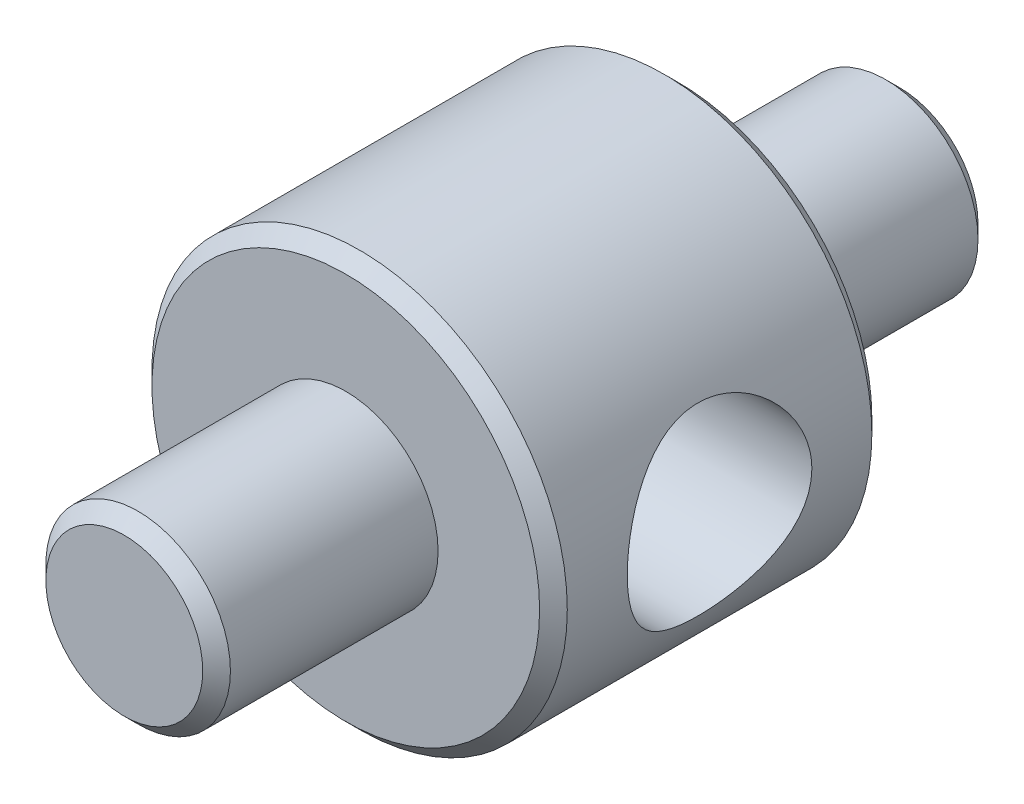
ISO-10303-21;
HEADER;
FILE_DESCRIPTION(('STEP AP214'),'2;1');
FILE_NAME('part.step','',(''),(''),'','','');
FILE_SCHEMA(('AUTOMOTIVE_DESIGN { 1 0 10303 214 1 1 1 1 }'));
ENDSEC;
DATA;
#1=APPLICATION_CONTEXT('core data for automotive mechanical design processes');
#2=APPLICATION_PROTOCOL_DEFINITION('international standard','automotive_design',2000,#1);
#3=PRODUCT_CONTEXT('',#1,'mechanical');
#4=PRODUCT('Part','Part','',(#3));
#5=PRODUCT_RELATED_PRODUCT_CATEGORY('part','',(#4));
#6=PRODUCT_DEFINITION_FORMATION('','',#4);
#7=PRODUCT_DEFINITION_CONTEXT('part definition',#1,'design');
#8=PRODUCT_DEFINITION('design','',#6,#7);
#9=PRODUCT_DEFINITION_SHAPE('','',#8);
#10=(LENGTH_UNIT() NAMED_UNIT(*) SI_UNIT(.MILLI.,.METRE.));
#11=(NAMED_UNIT(*) PLANE_ANGLE_UNIT() SI_UNIT($,.RADIAN.));
#12=(NAMED_UNIT(*) SI_UNIT($,.STERADIAN.) SOLID_ANGLE_UNIT());
#13=UNCERTAINTY_MEASURE_WITH_UNIT(LENGTH_MEASURE(1.E-05),#10,'distance_accuracy_value','');
#14=(GEOMETRIC_REPRESENTATION_CONTEXT(3) GLOBAL_UNCERTAINTY_ASSIGNED_CONTEXT((#13)) GLOBAL_UNIT_ASSIGNED_CONTEXT((#10,
#11,#12)) REPRESENTATION_CONTEXT('',''));
#15=CARTESIAN_POINT('',(0.,0.,0.));
#16=DIRECTION('',(0.,0.,1.));
#17=DIRECTION('',(1.,0.,0.));
#18=AXIS2_PLACEMENT_3D('',#15,#16,#17);
#19=CARTESIAN_POINT('',(0.,0.,18.));
#20=DIRECTION('',(0.,0.,-1.));
#21=DIRECTION('',(-1.,0.,0.));
#22=AXIS2_PLACEMENT_3D('',#19,#20,#21);
#23=CYLINDRICAL_SURFACE('',#22,22.5);
#24=CARTESIAN_POINT('',(-22.5,0.,-10.));
#25=CARTESIAN_POINT('',(-22.4999983412741,0.266358674506629,-9.99999801489142));
#26=CARTESIAN_POINT('',(-22.4952577550859,0.532785210886051,-9.98934407429766));
#27=CARTESIAN_POINT('',(-22.4764129887687,1.06372052827526,-9.94683332964316));
#28=CARTESIAN_POINT('',(-22.4623034599646,1.3282281265239,-9.91496441404969));
#29=CARTESIAN_POINT('',(-22.4250533191297,1.85378409880719,-9.83028307683902));
#30=CARTESIAN_POINT('',(-22.4018943007243,2.11482429416228,-9.77742796641402));
#31=CARTESIAN_POINT('',(-22.3471481148333,2.63103736565179,-9.65133414309113));
#32=CARTESIAN_POINT('',(-22.3155603486292,2.88620982358468,-9.57809398216803));
#33=CARTESIAN_POINT('',(-22.2448892220841,3.38804988474801,-9.41226320369187));
#34=CARTESIAN_POINT('',(-22.2058338172876,3.63474528214795,-9.31974464349954));
#35=CARTESIAN_POINT('',(-22.1211070120447,4.11911290035001,-9.11602719514624));
#36=CARTESIAN_POINT('',(-22.0754354056065,4.35678483992094,-9.00482772534838));
#37=CARTESIAN_POINT('',(-21.9785761888309,4.82167159326358,-8.76469499017571));
#38=CARTESIAN_POINT('',(-21.9273913187015,5.04889152249531,-8.63577052576966));
#39=CARTESIAN_POINT('',(-21.8206650853107,5.49186561087359,-8.36106562417567));
#40=CARTESIAN_POINT('',(-21.7651221240651,5.70761551519558,-8.21527899474929));
#41=CARTESIAN_POINT('',(-21.5880568498737,6.35714242369687,-7.73850030503356));
#42=CARTESIAN_POINT('',(-21.4611409325697,6.76979822740147,-7.38012792068984));
#43=CARTESIAN_POINT('',(-21.2058946147112,7.53139326958645,-6.60114247843569));
#44=CARTESIAN_POINT('',(-21.0775634189794,7.88029452728651,-6.18049258800698));
#45=CARTESIAN_POINT('',(-20.8904888985783,8.35877756226238,-5.49676219265885));
#46=CARTESIAN_POINT('',(-20.8274141488895,8.51431075280241,-5.25266913044278));
#47=CARTESIAN_POINT('',(-20.706580039709,8.80409930019552,-4.75096387485483));
#48=CARTESIAN_POINT('',(-20.6488184651489,8.93836354110986,-4.4933573862268));
#49=CARTESIAN_POINT('',(-20.5405571154436,9.184421545613,-3.96623247962893));
#50=CARTESIAN_POINT('',(-20.4900557283934,9.29622029918278,-3.69671672317797));
#51=CARTESIAN_POINT('',(-20.3981349149272,9.49622142398353,-3.14756074684072));
#52=CARTESIAN_POINT('',(-20.3567147069907,9.58442582587336,-2.86792140059931));
#53=CARTESIAN_POINT('',(-20.2864713022003,9.73218489954871,-2.3155897322206));
#54=CARTESIAN_POINT('',(-20.2571004246296,9.79300174905989,-2.04330481322032));
#55=CARTESIAN_POINT('',(-20.2090612627247,9.89175779481313,-1.4936771914048));
#56=CARTESIAN_POINT('',(-20.1903926080827,9.92969778262004,-1.21633466393058));
#57=CARTESIAN_POINT('',(-20.1644973394177,9.98217951008383,-0.659070013584596));
#58=CARTESIAN_POINT('',(-20.1572641728748,9.99673464930624,-0.37914946047934));
#59=CARTESIAN_POINT('',(-20.1545116933501,10.0022834901155,0.180974132128588));
#60=CARTESIAN_POINT('',(-20.1589916277639,9.993278705503,0.461177152325461));
#61=CARTESIAN_POINT('',(-20.178556996954,9.95370553775353,0.994311539194443));
#62=CARTESIAN_POINT('',(-20.1926536074241,9.92514683895553,1.24743167715935));
#63=CARTESIAN_POINT('',(-20.2299357176033,9.84893398121707,1.75018866603186));
#64=CARTESIAN_POINT('',(-20.2531243076265,9.80127332950511,1.99982430266817));
#65=CARTESIAN_POINT('',(-20.3078519348151,9.68736967775726,2.49381495021869));
#66=CARTESIAN_POINT('',(-20.3393891895847,9.62113064392871,2.73817107625066));
#67=CARTESIAN_POINT('',(-20.4098821228145,9.47067093458348,3.22027775721418));
#68=CARTESIAN_POINT('',(-20.4488407242047,9.38644317253835,3.45802566705101));
#69=CARTESIAN_POINT('',(-20.5339927684761,9.19869507343533,3.93065940340294));
#70=CARTESIAN_POINT('',(-20.5803264052518,9.09479139530678,4.16536747547223));
#71=CARTESIAN_POINT('',(-20.6783222006865,8.86972683399475,4.62531422771477));
#72=CARTESIAN_POINT('',(-20.7299866437201,8.74855854398004,4.85054878958468));
#73=CARTESIAN_POINT('',(-20.8372968943357,8.48979808494964,5.29041076733051));
#74=CARTESIAN_POINT('',(-20.8929431658974,8.35220400067697,5.50503694212868));
#75=CARTESIAN_POINT('',(-21.0068589492686,8.06140567885882,5.9227107488607));
#76=CARTESIAN_POINT('',(-21.0651286283891,7.90820044490401,6.12575764043459));
#77=CARTESIAN_POINT('',(-21.1887005762833,7.57127612315421,6.53861837350061));
#78=CARTESIAN_POINT('',(-21.254133812688,7.38603823151229,6.74715584420609));
#79=CARTESIAN_POINT('',(-21.3847641683632,6.99882808584691,7.14800953933823));
#80=CARTESIAN_POINT('',(-21.4499613534205,6.79686094083625,7.34033068019162));
#81=CARTESIAN_POINT('',(-21.5784874997096,6.37707504510995,7.70783899814699));
#82=CARTESIAN_POINT('',(-21.6418151491746,6.15924551934532,7.88301433543272));
#83=CARTESIAN_POINT('',(-21.7648901464863,5.709113060899,8.21487573203865));
#84=CARTESIAN_POINT('',(-21.8246389222671,5.47681597710945,8.37156918995315));
#85=CARTESIAN_POINT('',(-21.9407342792391,4.99181150591135,8.66978956457849));
#86=CARTESIAN_POINT('',(-21.9969259705791,4.73870176201838,8.81072380191943));
#87=CARTESIAN_POINT('',(-22.1022977955686,4.22000703014157,9.07059429202969));
#88=CARTESIAN_POINT('',(-22.1514777078841,3.95442164870328,9.18952985042368));
#89=CARTESIAN_POINT('',(-22.2413648148402,3.41277136658874,9.40413754279795));
#90=CARTESIAN_POINT('',(-22.2820763099849,3.13671186960291,9.49982148878462));
#91=CARTESIAN_POINT('',(-22.3538236970007,2.57611847726868,9.66690930787201));
#92=CARTESIAN_POINT('',(-22.3848604401935,2.2915853299672,9.73831531733953));
#93=CARTESIAN_POINT('',(-22.4344936419773,1.73655379186009,9.85184842232812));
#94=CARTESIAN_POINT('',(-22.4538085491568,1.46646625264617,9.89567445854468));
#95=CARTESIAN_POINT('',(-22.4827022481691,0.923093824753187,9.96106249991966));
#96=CARTESIAN_POINT('',(-22.492281491961,0.649809085093726,9.98262553859495));
#97=CARTESIAN_POINT('',(-22.5014327813663,0.102305199893459,10.0032275607149));
#98=CARTESIAN_POINT('',(-22.5010077394445,-0.171913650464062,10.0022730994924));
#99=CARTESIAN_POINT('',(-22.4901693364661,-0.719144891104904,9.97786740741689));
#100=CARTESIAN_POINT('',(-22.4797562573607,-0.992157315225745,9.95441681160476));
#101=CARTESIAN_POINT('',(-22.4501266532091,-1.5189915807864,9.88731655373121));
#102=CARTESIAN_POINT('',(-22.4314577903456,-1.77300551778789,9.84492197887201));
#103=CARTESIAN_POINT('',(-22.3859845778249,-2.2762980737003,9.74086726803527));
#104=CARTESIAN_POINT('',(-22.3591806218089,-2.52557692111295,9.6792080642313));
#105=CARTESIAN_POINT('',(-22.2980830127615,-3.0177798863728,9.53722228352212));
#106=CARTESIAN_POINT('',(-22.2637901456724,-3.26070466806966,9.45689766544831));
#107=CARTESIAN_POINT('',(-22.1884984795923,-3.7388693183974,9.27825549703403));
#108=CARTESIAN_POINT('',(-22.1474971105102,-3.97410620011853,9.17993104906421));
#109=CARTESIAN_POINT('',(-22.0583710838479,-4.4426193877379,8.96280280783393));
#110=CARTESIAN_POINT('',(-22.010065898814,-4.67561206078989,8.84346144460099));
#111=CARTESIAN_POINT('',(-21.908433598371,-5.13078390971223,8.58739045891613));
#112=CARTESIAN_POINT('',(-21.8551047719357,-5.35295936192739,8.4506549064971));
#113=CARTESIAN_POINT('',(-21.744642321343,-5.78535529571012,8.160725126261));
#114=CARTESIAN_POINT('',(-21.6875079761197,-5.99557349755944,8.00752777588658));
#115=CARTESIAN_POINT('',(-21.5707242991031,-6.40302886015366,7.68561275034613));
#116=CARTESIAN_POINT('',(-21.5110748459504,-6.60026539332612,7.51689432578923));
#117=CARTESIAN_POINT('',(-21.38572348661,-6.99623977160872,7.1506032700088));
#118=CARTESIAN_POINT('',(-21.3199221098287,-7.19381006998432,6.95180065996954));
#119=CARTESIAN_POINT('',(-21.1887052352925,-7.57157516822001,6.5383216067555));
#120=CARTESIAN_POINT('',(-21.1232896306177,-7.7517750176108,6.32364980895648));
#121=CARTESIAN_POINT('',(-20.9945797859484,-8.09388924179568,5.87942046829087));
#122=CARTESIAN_POINT('',(-20.9312865688396,-8.25579488629138,5.64985589991669));
#123=CARTESIAN_POINT('',(-20.8086644919195,-8.56016436228012,5.1771249604688));
#124=CARTESIAN_POINT('',(-20.7493361215173,-8.70262579589177,4.93395691700349));
#125=CARTESIAN_POINT('',(-20.6351213631842,-8.97014113507602,4.42944810766799));
#126=CARTESIAN_POINT('',(-20.5803743435446,-9.09469990199382,4.16781253194244));
#127=CARTESIAN_POINT('',(-20.4788579023647,-9.32103921932125,3.63350483395783));
#128=CARTESIAN_POINT('',(-20.4320847381341,-9.42283046316672,3.36083796423342));
#129=CARTESIAN_POINT('',(-20.3482468504859,-9.6025356438913,2.80645029954083));
#130=CARTESIAN_POINT('',(-20.3111766052706,-9.68046316559654,2.52473475698673));
#131=CARTESIAN_POINT('',(-20.2481926425272,-9.81152406599923,1.95437606654269));
#132=CARTESIAN_POINT('',(-20.222277664546,-9.86466024597034,1.66573370521908));
#133=CARTESIAN_POINT('',(-20.1843698111919,-9.94197643772676,1.10875008770604));
#134=CARTESIAN_POINT('',(-20.1713827745655,-9.96822966613534,0.840762703794265));
#135=CARTESIAN_POINT('',(-20.1561357409042,-9.99902478688881,0.303243244528133));
#136=CARTESIAN_POINT('',(-20.1538751110936,-10.0035679599608,0.0337112612325171));
#137=CARTESIAN_POINT('',(-20.1601645139545,-9.99088649900075,-0.5046580617197));
#138=CARTESIAN_POINT('',(-20.1687125217854,-9.9736659420863,-0.77349552203207));
#139=CARTESIAN_POINT('',(-20.196298945699,-9.91768517459673,-1.30836680601087));
#140=CARTESIAN_POINT('',(-20.2153371976009,-9.87892530112927,-1.57440067348938));
#141=CARTESIAN_POINT('',(-20.2617654840576,-9.78332716332782,-2.08566618198654));
#142=CARTESIAN_POINT('',(-20.2885807362236,-9.72772411668519,-2.33118280512387));
#143=CARTESIAN_POINT('',(-20.3500529208607,-9.59846160365254,-2.81649099138035));
#144=CARTESIAN_POINT('',(-20.3847125269139,-9.52479598029974,-3.05628057168104));
#145=CARTESIAN_POINT('',(-20.4608673563323,-9.36008167510315,-3.5286564779378));
#146=CARTESIAN_POINT('',(-20.5023616087251,-9.26903546216244,-3.76124382152048));
#147=CARTESIAN_POINT('',(-20.5910654560539,-9.07027346894596,-4.21808873074838));
#148=CARTESIAN_POINT('',(-20.6382771405329,-8.96255159020798,-4.44234321162513));
#149=CARTESIAN_POINT('',(-20.7930068459953,-8.60073036887333,-5.12891739777555));
#150=CARTESIAN_POINT('',(-20.9085624707511,-8.31840632323343,-5.5749207966406));
#151=CARTESIAN_POINT('',(-21.1482560424409,-7.68859265364666,-6.41574156812343));
#152=CARTESIAN_POINT('',(-21.2723975603181,-7.34107581132982,-6.8105374444338));
#153=CARTESIAN_POINT('',(-21.4615623012626,-6.7600210241619,-7.3745266720704));
#154=CARTESIAN_POINT('',(-21.5277465050087,-6.54670794344012,-7.56454357057132));
#155=CARTESIAN_POINT('',(-21.6573931597522,-6.10413045502065,-7.92597894664918));
#156=CARTESIAN_POINT('',(-21.7208564657984,-5.87487111875031,-8.09740329327397));
#157=CARTESIAN_POINT('',(-21.8433853752714,-5.40151273688932,-8.42056169047814));
#158=CARTESIAN_POINT('',(-21.9024477771704,-5.15740311817856,-8.57228146504076));
#159=CARTESIAN_POINT('',(-22.0144954122653,-4.65596026548334,-8.85464881838047));
#160=CARTESIAN_POINT('',(-22.0674811108367,-4.39862804632113,-8.98529801112928));
#161=CARTESIAN_POINT('',(-22.165327949851,-3.87534389039682,-9.22298029266647));
#162=CARTESIAN_POINT('',(-22.2102730712236,-3.60952001311623,-9.33026039701744));
#163=CARTESIAN_POINT('',(-22.2914633569308,-3.06846283264102,-9.52191574041082));
#164=CARTESIAN_POINT('',(-22.3277094716136,-2.79323056105034,-9.60629348162026));
#165=CARTESIAN_POINT('',(-22.3903507155281,-2.2361922261831,-9.75100247944083));
#166=CARTESIAN_POINT('',(-22.4167711762197,-1.95440508544985,-9.8113955983707));
#167=CARTESIAN_POINT('',(-22.4590737483085,-1.38603537042841,-9.90766770763661));
#168=CARTESIAN_POINT('',(-22.4749631808528,-1.09945626989597,-9.94356372881673));
#169=CARTESIAN_POINT('',(-22.4902249032581,-0.676807281399009,-9.97799030752754));
#170=CARTESIAN_POINT('',(-22.4938876174314,-0.541611708159812,-9.98624069441342));
#171=CARTESIAN_POINT('',(-22.4987756018156,-0.270949944583042,-9.99724607743069));
#172=CARTESIAN_POINT('',(-22.5000008437135,-0.135483751120323,-10.0000010097285));
#173=CARTESIAN_POINT('',(-22.5,0.,-10.));
#174=B_SPLINE_CURVE_WITH_KNOTS('',3,(#24,#25,#26,#27,#28,#29,#30,#31,#32,#33,#34,#35,#36,#37,
#38,#39,#40,#41,#42,#43,#44,#45,#46,#47,#48,#49,#50,#51,#52,#53,#54,#55,#56,#57,#58,#59,#60,#61,
#62,#63,#64,#65,#66,#67,#68,#69,#70,#71,#72,#73,#74,#75,#76,#77,#78,#79,#80,#81,#82,#83,#84,#85,
#86,#87,#88,#89,#90,#91,#92,#93,#94,#95,#96,#97,#98,#99,#100,#101,#102,#103,#104,#105,#106,#107,
#108,#109,#110,#111,#112,#113,#114,#115,#116,#117,#118,#119,#120,#121,#122,#123,#124,#125,#126,
#127,#128,#129,#130,#131,#132,#133,#134,#135,#136,#137,#138,#139,#140,#141,#142,#143,#144,#145,
#146,#147,#148,#149,#150,#151,#152,#153,#154,#155,#156,#157,#158,#159,#160,#161,#162,#163,#164,
#165,#166,#167,#168,#169,#170,#171,#172,#173),.UNSPECIFIED.,.T.,.F.,(4,2,2,2,2,2,2,2,2,2,2,2,2,
2,2,2,2,2,2,2,2,2,2,2,2,2,2,2,2,2,2,2,2,2,2,2,2,2,2,2,2,2,2,2,2,2,2,2,2,2,2,2,2,2,2,2,2,2,2,2,2,
2,2,2,2,2,2,2,2,2,2,2,2,2,4),(0.,0.798939988736112,1.59833648028421,2.39936745399693,
3.20045534241788,3.99860103417523,4.79677158109495,5.59454723518231,6.39261678960633,
8.06823192686051,9.74484205435457,10.6325756831291,11.5199375213358,12.4071020424309,
13.2941901847141,14.1346521822908,14.9750850972783,15.8150362705344,16.6549334755631,
17.4193840619599,18.1840947064805,18.9486422207896,19.713491480414,20.495151264384,
21.2771474099687,22.0592348259744,22.8413721914028,23.6999091725122,24.5581849215304,
25.4170492213531,26.2755685285795,27.1597265650926,28.0439125047716,28.9276483274309,
29.811306364534,30.6331401318182,31.4549357453345,32.2764921192689,33.0980253022626,
33.8717427906967,34.6454228464181,35.4190217453607,36.1929177143791,36.990654006547,
37.7886629927483,38.5868236174462,39.3850227993026,40.2477471216788,41.1102198918944,
41.9731025254806,42.8360914747369,43.7196246852545,44.6027420429537,45.4853557326304,
46.3678696680602,47.1755535918615,47.9831898679062,48.7906748674939,49.5981472296472,
50.3567815506315,51.1156748265053,51.874460382119,52.6335240918381,54.2474381734601,
55.8620275792542,56.7408578711325,57.6194099332247,58.4985949995076,59.377712689651,
60.2470308231936,61.1162539422829,61.9832203267677,62.8495833641855,63.2559607029152,
63.6623427619733),.UNSPECIFIED.);
#175=CARTESIAN_POINT('',(-22.5,0.,-10.));
#176=VERTEX_POINT('',#175);
#177=EDGE_CURVE('E67',#176,#176,#174,.T.);
#178=ORIENTED_EDGE('',*,*,#177,.T.);
#179=EDGE_LOOP('',(#178));
#180=FACE_BOUND('',#179,.T.);
#181=CARTESIAN_POINT('',(22.5,0.,-10.));
#182=CARTESIAN_POINT('',(22.4999983412741,-0.266358674506631,-9.99999801489142));
#183=CARTESIAN_POINT('',(22.4952577550859,-0.532785210886055,-9.98934407429766));
#184=CARTESIAN_POINT('',(22.4764129887687,-1.06372052827527,-9.94683332964316));
#185=CARTESIAN_POINT('',(22.4623034599646,-1.3282281265239,-9.91496441404969));
#186=CARTESIAN_POINT('',(22.4250533191297,-1.8537840988072,-9.83028307683902));
#187=CARTESIAN_POINT('',(22.4018943007243,-2.11482429416229,-9.77742796641402));
#188=CARTESIAN_POINT('',(22.3471481148333,-2.63103736565179,-9.65133414309113));
#189=CARTESIAN_POINT('',(22.3155603486292,-2.88620982358468,-9.57809398216803));
#190=CARTESIAN_POINT('',(22.2448892220841,-3.38804988474801,-9.41226320369187));
#191=CARTESIAN_POINT('',(22.2058338172876,-3.63474528214795,-9.31974464349954));
#192=CARTESIAN_POINT('',(22.1211070120447,-4.11911290035001,-9.11602719514624));
#193=CARTESIAN_POINT('',(22.0754354056065,-4.35678483992094,-9.00482772534838));
#194=CARTESIAN_POINT('',(21.9785761888309,-4.82167159326358,-8.76469499017571));
#195=CARTESIAN_POINT('',(21.9273913187015,-5.04889152249532,-8.63577052576966));
#196=CARTESIAN_POINT('',(21.8206650853107,-5.49186561087359,-8.36106562417567));
#197=CARTESIAN_POINT('',(21.7651221240651,-5.70761551519558,-8.21527899474929));
#198=CARTESIAN_POINT('',(21.5880568498737,-6.35714242369687,-7.73850030503356));
#199=CARTESIAN_POINT('',(21.4611409325697,-6.76979822740148,-7.38012792068984));
#200=CARTESIAN_POINT('',(21.2058946147112,-7.53139326958646,-6.60114247843568));
#201=CARTESIAN_POINT('',(21.0775634189794,-7.88029452728653,-6.18049258800698));
#202=CARTESIAN_POINT('',(20.8904888985783,-8.35877756226239,-5.49676219265884));
#203=CARTESIAN_POINT('',(20.8274141488895,-8.51431075280241,-5.25266913044277));
#204=CARTESIAN_POINT('',(20.706580039709,-8.80409930019552,-4.75096387485482));
#205=CARTESIAN_POINT('',(20.6488184651489,-8.93836354110986,-4.49335738622679));
#206=CARTESIAN_POINT('',(20.5405571154436,-9.18442154561301,-3.96623247962893));
#207=CARTESIAN_POINT('',(20.4900557283934,-9.29622029918278,-3.69671672317796));
#208=CARTESIAN_POINT('',(20.3981349149272,-9.49622142398353,-3.14756074684071));
#209=CARTESIAN_POINT('',(20.3567147069907,-9.58442582587336,-2.86792140059931));
#210=CARTESIAN_POINT('',(20.2864713022003,-9.73218489954871,-2.3155897322206));
#211=CARTESIAN_POINT('',(20.2571004246296,-9.79300174905989,-2.04330481322031));
#212=CARTESIAN_POINT('',(20.2090612627247,-9.89175779481313,-1.4936771914048));
#213=CARTESIAN_POINT('',(20.1903926080827,-9.92969778262004,-1.21633466393058));
#214=CARTESIAN_POINT('',(20.1644973394177,-9.98217951008384,-0.65907001358459));
#215=CARTESIAN_POINT('',(20.1572641728748,-9.99673464930624,-0.379149460479334));
#216=CARTESIAN_POINT('',(20.1545116933501,-10.0022834901155,0.180974132128594));
#217=CARTESIAN_POINT('',(20.1589916277639,-9.99327870550299,0.461177152325467));
#218=CARTESIAN_POINT('',(20.178556996954,-9.95370553775352,0.99431153919445));
#219=CARTESIAN_POINT('',(20.1926536074241,-9.92514683895552,1.24743167715936));
#220=CARTESIAN_POINT('',(20.2299357176033,-9.84893398121707,1.75018866603187));
#221=CARTESIAN_POINT('',(20.2531243076265,-9.80127332950511,1.99982430266817));
#222=CARTESIAN_POINT('',(20.3078519348151,-9.68736967775726,2.49381495021869));
#223=CARTESIAN_POINT('',(20.3393891895847,-9.62113064392871,2.73817107625067));
#224=CARTESIAN_POINT('',(20.4098821228145,-9.47067093458347,3.22027775721419));
#225=CARTESIAN_POINT('',(20.4488407242047,-9.38644317253833,3.45802566705101));
#226=CARTESIAN_POINT('',(20.5339927684761,-9.19869507343532,3.93065940340295));
#227=CARTESIAN_POINT('',(20.5803264052518,-9.09479139530677,4.16536747547223));
#228=CARTESIAN_POINT('',(20.6783222006865,-8.86972683399475,4.62531422771478));
#229=CARTESIAN_POINT('',(20.7299866437201,-8.74855854398003,4.85054878958469));
#230=CARTESIAN_POINT('',(20.8372968943357,-8.48979808494964,5.29041076733051));
#231=CARTESIAN_POINT('',(20.8929431658974,-8.35220400067697,5.50503694212868));
#232=CARTESIAN_POINT('',(21.0068589492686,-8.06140567885882,5.92271074886071));
#233=CARTESIAN_POINT('',(21.0651286283891,-7.90820044490401,6.12575764043459));
#234=CARTESIAN_POINT('',(21.1887005762833,-7.57127612315421,6.53861837350061));
#235=CARTESIAN_POINT('',(21.254133812688,-7.38603823151229,6.74715584420609));
#236=CARTESIAN_POINT('',(21.3847641683632,-6.99882808584691,7.14800953933823));
#237=CARTESIAN_POINT('',(21.4499613534205,-6.79686094083624,7.34033068019162));
#238=CARTESIAN_POINT('',(21.5784874997096,-6.37707504510995,7.70783899814699));
#239=CARTESIAN_POINT('',(21.6418151491746,-6.15924551934532,7.88301433543273));
#240=CARTESIAN_POINT('',(21.7648901464863,-5.709113060899,8.21487573203865));
#241=CARTESIAN_POINT('',(21.8246389222671,-5.47681597710945,8.37156918995315));
#242=CARTESIAN_POINT('',(21.9407342792391,-4.99181150591135,8.66978956457849));
#243=CARTESIAN_POINT('',(21.9969259705791,-4.73870176201838,8.81072380191944));
#244=CARTESIAN_POINT('',(22.1022977955686,-4.22000703014157,9.07059429202969));
#245=CARTESIAN_POINT('',(22.1514777078841,-3.95442164870328,9.18952985042368));
#246=CARTESIAN_POINT('',(22.2413648148402,-3.41277136658874,9.40413754279795));
#247=CARTESIAN_POINT('',(22.2820763099849,-3.13671186960291,9.49982148878462));
#248=CARTESIAN_POINT('',(22.3538236970007,-2.57611847726868,9.66690930787201));
#249=CARTESIAN_POINT('',(22.3848604401935,-2.2915853299672,9.73831531733953));
#250=CARTESIAN_POINT('',(22.4344936419773,-1.73655379186009,9.85184842232812));
#251=CARTESIAN_POINT('',(22.4538085491568,-1.46646625264617,9.89567445854468));
#252=CARTESIAN_POINT('',(22.4827022481691,-0.923093824753189,9.96106249991967));
#253=CARTESIAN_POINT('',(22.492281491961,-0.649809085093728,9.98262553859495));
#254=CARTESIAN_POINT('',(22.5014327813663,-0.102305199893463,10.0032275607149));
#255=CARTESIAN_POINT('',(22.5010077394445,0.171913650464058,10.0022730994924));
#256=CARTESIAN_POINT('',(22.4901693364661,0.719144891104901,9.97786740741689));
#257=CARTESIAN_POINT('',(22.4797562573607,0.992157315225743,9.95441681160476));
#258=CARTESIAN_POINT('',(22.4501266532091,1.5189915807864,9.88731655373121));
#259=CARTESIAN_POINT('',(22.4314577903456,1.77300551778789,9.84492197887201));
#260=CARTESIAN_POINT('',(22.3859845778249,2.27629807370031,9.74086726803527));
#261=CARTESIAN_POINT('',(22.3591806218089,2.52557692111296,9.6792080642313));
#262=CARTESIAN_POINT('',(22.2980830127615,3.01777988637281,9.53722228352212));
#263=CARTESIAN_POINT('',(22.2637901456724,3.26070466806968,9.4568976654483));
#264=CARTESIAN_POINT('',(22.1884984795923,3.73886931839742,9.27825549703403));
#265=CARTESIAN_POINT('',(22.1474971105102,3.97410620011856,9.1799310490642));
#266=CARTESIAN_POINT('',(22.0583710838479,4.44261938773793,8.96280280783393));
#267=CARTESIAN_POINT('',(22.010065898814,4.67561206078991,8.84346144460098));
#268=CARTESIAN_POINT('',(21.908433598371,5.13078390971224,8.58739045891612));
#269=CARTESIAN_POINT('',(21.8551047719357,5.35295936192741,8.45065490649709));
#270=CARTESIAN_POINT('',(21.744642321343,5.78535529571014,8.16072512626099));
#271=CARTESIAN_POINT('',(21.6875079761196,5.99557349755945,8.00752777588657));
#272=CARTESIAN_POINT('',(21.5707242991031,6.40302886015366,7.68561275034612));
#273=CARTESIAN_POINT('',(21.5110748459504,6.60026539332612,7.51689432578922));
#274=CARTESIAN_POINT('',(21.38572348661,6.99623977160872,7.15060327000879));
#275=CARTESIAN_POINT('',(21.3199221098287,7.19381006998432,6.95180065996953));
#276=CARTESIAN_POINT('',(21.1887052352925,7.57157516822002,6.5383216067555));
#277=CARTESIAN_POINT('',(21.1232896306177,7.7517750176108,6.32364980895648));
#278=CARTESIAN_POINT('',(20.9945797859484,8.09388924179569,5.87942046829086));
#279=CARTESIAN_POINT('',(20.9312865688396,8.25579488629139,5.64985589991669));
#280=CARTESIAN_POINT('',(20.8086644919195,8.56016436228012,5.17712496046879));
#281=CARTESIAN_POINT('',(20.7493361215173,8.70262579589177,4.93395691700348));
#282=CARTESIAN_POINT('',(20.6351213631842,8.97014113507602,4.42944810766798));
#283=CARTESIAN_POINT('',(20.5803743435446,9.09469990199382,4.16781253194243));
#284=CARTESIAN_POINT('',(20.4788579023647,9.32103921932126,3.63350483395782));
#285=CARTESIAN_POINT('',(20.4320847381341,9.42283046316673,3.3608379642334));
#286=CARTESIAN_POINT('',(20.3482468504859,9.60253564389131,2.80645029954081));
#287=CARTESIAN_POINT('',(20.3111766052706,9.68046316559655,2.52473475698672));
#288=CARTESIAN_POINT('',(20.2481926425272,9.81152406599923,1.95437606654268));
#289=CARTESIAN_POINT('',(20.222277664546,9.86466024597034,1.66573370521907));
#290=CARTESIAN_POINT('',(20.1843698111919,9.94197643772676,1.10875008770603));
#291=CARTESIAN_POINT('',(20.1713827745655,9.96822966613534,0.840762703794257));
#292=CARTESIAN_POINT('',(20.1561357409042,9.99902478688881,0.303243244528124));
#293=CARTESIAN_POINT('',(20.1538751110936,10.0035679599608,0.0337112612325072));
#294=CARTESIAN_POINT('',(20.1601645139545,9.99088649900075,-0.50465806171971));
#295=CARTESIAN_POINT('',(20.1687125217854,9.9736659420863,-0.773495522032078));
#296=CARTESIAN_POINT('',(20.196298945699,9.91768517459673,-1.30836680601087));
#297=CARTESIAN_POINT('',(20.2153371976009,9.87892530112926,-1.57440067348939));
#298=CARTESIAN_POINT('',(20.2617654840576,9.78332716332781,-2.08566618198654));
#299=CARTESIAN_POINT('',(20.2885807362236,9.72772411668519,-2.33118280512388));
#300=CARTESIAN_POINT('',(20.3500529208607,9.59846160365254,-2.81649099138036));
#301=CARTESIAN_POINT('',(20.3847125269139,9.52479598029974,-3.05628057168105));
#302=CARTESIAN_POINT('',(20.4608673563323,9.36008167510314,-3.52865647793781));
#303=CARTESIAN_POINT('',(20.5023616087251,9.26903546216244,-3.76124382152049));
#304=CARTESIAN_POINT('',(20.5910654560539,9.07027346894596,-4.21808873074838));
#305=CARTESIAN_POINT('',(20.6382771405329,8.96255159020798,-4.44234321162514));
#306=CARTESIAN_POINT('',(20.7930068459953,8.60073036887333,-5.12891739777556));
#307=CARTESIAN_POINT('',(20.9085624707511,8.31840632323342,-5.5749207966406));
#308=CARTESIAN_POINT('',(21.1482560424409,7.68859265364665,-6.41574156812343));
#309=CARTESIAN_POINT('',(21.2723975603181,7.34107581132982,-6.81053744443381));
#310=CARTESIAN_POINT('',(21.4615623012626,6.7600210241619,-7.3745266720704));
#311=CARTESIAN_POINT('',(21.5277465050087,6.54670794344012,-7.56454357057132));
#312=CARTESIAN_POINT('',(21.6573931597522,6.10413045502064,-7.92597894664919));
#313=CARTESIAN_POINT('',(21.7208564657984,5.87487111875031,-8.09740329327398));
#314=CARTESIAN_POINT('',(21.8433853752714,5.40151273688932,-8.42056169047814));
#315=CARTESIAN_POINT('',(21.9024477771704,5.15740311817856,-8.57228146504076));
#316=CARTESIAN_POINT('',(22.0144954122653,4.65596026548333,-8.85464881838047));
#317=CARTESIAN_POINT('',(22.0674811108367,4.39862804632113,-8.98529801112928));
#318=CARTESIAN_POINT('',(22.165327949851,3.87534389039682,-9.22298029266647));
#319=CARTESIAN_POINT('',(22.2102730712236,3.60952001311623,-9.33026039701744));
#320=CARTESIAN_POINT('',(22.2914633569308,3.06846283264102,-9.52191574041082));
#321=CARTESIAN_POINT('',(22.3277094716136,2.79323056105034,-9.60629348162026));
#322=CARTESIAN_POINT('',(22.3903507155281,2.2361922261831,-9.75100247944083));
#323=CARTESIAN_POINT('',(22.4167711762197,1.95440508544985,-9.8113955983707));
#324=CARTESIAN_POINT('',(22.4590737483085,1.38603537042841,-9.90766770763661));
#325=CARTESIAN_POINT('',(22.4749631808527,1.09945626989597,-9.94356372881673));
#326=CARTESIAN_POINT('',(22.4902249032581,0.676807281399004,-9.97799030752754));
#327=CARTESIAN_POINT('',(22.4938876174314,0.541611708159803,-9.98624069441342));
#328=CARTESIAN_POINT('',(22.4987756018156,0.270949944583034,-9.99724607743069));
#329=CARTESIAN_POINT('',(22.5000008437135,0.135483751120319,-10.0000010097285));
#330=CARTESIAN_POINT('',(22.5,0.,-10.));
#331=B_SPLINE_CURVE_WITH_KNOTS('',3,(#181,#182,#183,#184,#185,#186,#187,#188,#189,#190,#191,
#192,#193,#194,#195,#196,#197,#198,#199,#200,#201,#202,#203,#204,#205,#206,#207,#208,#209,#210,
#211,#212,#213,#214,#215,#216,#217,#218,#219,#220,#221,#222,#223,#224,#225,#226,#227,#228,#229,
#230,#231,#232,#233,#234,#235,#236,#237,#238,#239,#240,#241,#242,#243,#244,#245,#246,#247,#248,
#249,#250,#251,#252,#253,#254,#255,#256,#257,#258,#259,#260,#261,#262,#263,#264,#265,#266,#267,
#268,#269,#270,#271,#272,#273,#274,#275,#276,#277,#278,#279,#280,#281,#282,#283,#284,#285,#286,
#287,#288,#289,#290,#291,#292,#293,#294,#295,#296,#297,#298,#299,#300,#301,#302,#303,#304,#305,
#306,#307,#308,#309,#310,#311,#312,#313,#314,#315,#316,#317,#318,#319,#320,#321,#322,#323,#324,
#325,#326,#327,#328,#329,#330),.UNSPECIFIED.,.T.,.F.,(4,2,2,2,2,2,2,2,2,2,2,2,2,2,2,2,2,2,2,2,2,
2,2,2,2,2,2,2,2,2,2,2,2,2,2,2,2,2,2,2,2,2,2,2,2,2,2,2,2,2,2,2,2,2,2,2,2,2,2,2,2,2,2,2,2,2,2,2,2,
2,2,2,2,2,4),(0.,0.798939988736116,1.59833648028422,2.39936745399693,3.20045534241788,
3.99860103417523,4.79677158109495,5.59454723518231,6.39261678960633,8.06823192686052,
9.74484205435458,10.6325756831291,11.5199375213358,12.4071020424309,13.2941901847141,
14.1346521822908,14.9750850972784,15.8150362705344,16.6549334755631,17.4193840619599,
18.1840947064805,18.9486422207896,19.713491480414,20.495151264384,21.2771474099687,
22.0592348259744,22.8413721914028,23.6999091725123,24.5581849215304,25.4170492213531,
26.2755685285795,27.1597265650926,28.0439125047716,28.9276483274309,29.811306364534,
30.6331401318182,31.4549357453345,32.2764921192689,33.0980253022627,33.8717427906967,
34.6454228464181,35.4190217453608,36.1929177143792,36.9906540065471,37.7886629927483,
38.5868236174462,39.3850227993026,40.2477471216788,41.1102198918945,41.9731025254806,
42.836091474737,43.7196246852545,44.6027420429537,45.4853557326304,46.3678696680602,
47.1755535918615,47.9831898679063,48.790674867494,49.5981472296473,50.3567815506315,
51.1156748265053,51.874460382119,52.6335240918381,54.2474381734601,55.8620275792542,
56.7408578711325,57.6194099332247,58.4985949995076,59.377712689651,60.2470308231936,
61.1162539422829,61.9832203267678,62.8495833641855,63.2559607029152,63.6623427619733),.UNSPECIFIED.);
#332=CARTESIAN_POINT('',(22.5,0.,-10.));
#333=VERTEX_POINT('',#332);
#334=EDGE_CURVE('E76',#333,#333,#331,.T.);
#335=ORIENTED_EDGE('',*,*,#334,.T.);
#336=EDGE_LOOP('',(#335));
#337=FACE_BOUND('',#336,.T.);
#338=CARTESIAN_POINT('',(0.,0.,-16.5));
#339=DIRECTION('',(0.,0.,1.));
#340=DIRECTION('',(1.,0.,0.));
#341=AXIS2_PLACEMENT_3D('',#338,#339,#340);
#342=CIRCLE('',#341,22.5);
#343=CARTESIAN_POINT('',(22.5,0.,-16.5));
#344=VERTEX_POINT('',#343);
#345=EDGE_CURVE('E30',#344,#344,#342,.T.);
#346=ORIENTED_EDGE('',*,*,#345,.T.);
#347=EDGE_LOOP('',(#346));
#348=FACE_BOUND('',#347,.T.);
#349=CARTESIAN_POINT('',(0.,0.,16.5));
#350=DIRECTION('',(0.,0.,1.));
#351=DIRECTION('',(1.,0.,0.));
#352=AXIS2_PLACEMENT_3D('',#349,#350,#351);
#353=CIRCLE('',#352,22.5);
#354=CARTESIAN_POINT('',(22.5,0.,16.5));
#355=VERTEX_POINT('',#354);
#356=EDGE_CURVE('E37',#355,#355,#353,.F.);
#357=ORIENTED_EDGE('',*,*,#356,.T.);
#358=EDGE_LOOP('',(#357));
#359=FACE_BOUND('',#358,.T.);
#360=ADVANCED_FACE('F14',(#180,#337,#348,#359),#23,.T.);
#361=CARTESIAN_POINT('',(0.,0.,18.));
#362=DIRECTION('',(0.,0.,1.));
#363=DIRECTION('',(1.,0.,0.));
#364=AXIS2_PLACEMENT_3D('',#361,#362,#363);
#365=PLANE('',#364);
#366=CARTESIAN_POINT('',(0.,0.,18.));
#367=DIRECTION('',(0.,0.,1.));
#368=DIRECTION('',(1.,0.,0.));
#369=AXIS2_PLACEMENT_3D('',#366,#367,#368);
#370=CIRCLE('',#369,21.);
#371=CARTESIAN_POINT('',(21.,0.,18.));
#372=VERTEX_POINT('',#371);
#373=EDGE_CURVE('E10',#372,#372,#370,.T.);
#374=ORIENTED_EDGE('',*,*,#373,.T.);
#375=EDGE_LOOP('',(#374));
#376=FACE_BOUND('',#375,.T.);
#377=CARTESIAN_POINT('',(0.,0.,18.));
#378=DIRECTION('',(0.,0.,1.));
#379=DIRECTION('',(1.,0.,0.));
#380=AXIS2_PLACEMENT_3D('',#377,#378,#379);
#381=CIRCLE('',#380,10.);
#382=CARTESIAN_POINT('',(10.,0.,18.));
#383=VERTEX_POINT('',#382);
#384=EDGE_CURVE('E63',#383,#383,#381,.F.);
#385=ORIENTED_EDGE('',*,*,#384,.T.);
#386=EDGE_LOOP('',(#385));
#387=FACE_BOUND('',#386,.T.);
#388=ADVANCED_FACE('F96',(#376,#387),#365,.T.);
#389=CARTESIAN_POINT('',(0.,0.,-18.));
#390=DIRECTION('',(0.,0.,1.));
#391=DIRECTION('',(1.,0.,0.));
#392=AXIS2_PLACEMENT_3D('',#389,#390,#391);
#393=PLANE('',#392);
#394=CARTESIAN_POINT('',(0.,0.,-18.));
#395=DIRECTION('',(0.,0.,1.));
#396=DIRECTION('',(1.,0.,0.));
#397=AXIS2_PLACEMENT_3D('',#394,#395,#396);
#398=CIRCLE('',#397,21.);
#399=CARTESIAN_POINT('',(21.,0.,-18.));
#400=VERTEX_POINT('',#399);
#401=EDGE_CURVE('E22',#400,#400,#398,.F.);
#402=ORIENTED_EDGE('',*,*,#401,.T.);
#403=EDGE_LOOP('',(#402));
#404=FACE_BOUND('',#403,.T.);
#405=CARTESIAN_POINT('',(0.,0.,-18.));
#406=DIRECTION('',(0.,0.,1.));
#407=DIRECTION('',(1.,0.,0.));
#408=AXIS2_PLACEMENT_3D('',#405,#406,#407);
#409=CIRCLE('',#408,10.);
#410=CARTESIAN_POINT('',(10.,0.,-18.));
#411=VERTEX_POINT('',#410);
#412=EDGE_CURVE('E59',#411,#411,#409,.F.);
#413=ORIENTED_EDGE('',*,*,#412,.F.);
#414=EDGE_LOOP('',(#413));
#415=FACE_BOUND('',#414,.T.);
#416=ADVANCED_FACE('F102',(#404,#415),#393,.F.);
#417=CARTESIAN_POINT('',(0.,0.,-42.));
#418=DIRECTION('',(0.,0.,1.));
#419=DIRECTION('',(1.,0.,0.));
#420=AXIS2_PLACEMENT_3D('',#417,#418,#419);
#421=PLANE('',#420);
#422=CARTESIAN_POINT('',(0.,0.,-42.));
#423=DIRECTION('',(0.,0.,1.));
#424=DIRECTION('',(1.,0.,0.));
#425=AXIS2_PLACEMENT_3D('',#422,#423,#424);
#426=CIRCLE('',#425,8.49999999999996);
#427=CARTESIAN_POINT('',(8.49999999999996,0.,-42.));
#428=VERTEX_POINT('',#427);
#429=EDGE_CURVE('E43',#428,#428,#426,.F.);
#430=ORIENTED_EDGE('',*,*,#429,.T.);
#431=EDGE_LOOP('',(#430));
#432=FACE_BOUND('',#431,.T.);
#433=ADVANCED_FACE('F161',(#432),#421,.F.);
#434=CARTESIAN_POINT('',(0.,0.,42.));
#435=DIRECTION('',(0.,0.,-1.));
#436=DIRECTION('',(-1.,0.,0.));
#437=AXIS2_PLACEMENT_3D('',#434,#435,#436);
#438=CYLINDRICAL_SURFACE('',#437,10.);
#439=CARTESIAN_POINT('',(0.,0.,-40.5));
#440=DIRECTION('',(0.,0.,1.));
#441=DIRECTION('',(1.,0.,0.));
#442=AXIS2_PLACEMENT_3D('',#439,#440,#441);
#443=CIRCLE('',#442,10.);
#444=CARTESIAN_POINT('',(10.,0.,-40.5));
#445=VERTEX_POINT('',#444);
#446=EDGE_CURVE('E47',#445,#445,#443,.T.);
#447=ORIENTED_EDGE('',*,*,#446,.T.);
#448=EDGE_LOOP('',(#447));
#449=FACE_BOUND('',#448,.T.);
#450=ORIENTED_EDGE('',*,*,#412,.T.);
#451=EDGE_LOOP('',(#450));
#452=FACE_BOUND('',#451,.T.);
#453=ADVANCED_FACE('F170',(#449,#452),#438,.T.);
#454=CARTESIAN_POINT('',(0.,0.,40.5));
#455=DIRECTION('',(0.,0.,1.));
#456=DIRECTION('',(1.,0.,0.));
#457=AXIS2_PLACEMENT_3D('',#454,#455,#456);
#458=CIRCLE('',#457,10.);
#459=CARTESIAN_POINT('',(10.,0.,40.5));
#460=VERTEX_POINT('',#459);
#461=EDGE_CURVE('E51',#460,#460,#458,.F.);
#462=ORIENTED_EDGE('',*,*,#461,.T.);
#463=EDGE_LOOP('',(#462));
#464=FACE_BOUND('',#463,.T.);
#465=ORIENTED_EDGE('',*,*,#384,.F.);
#466=EDGE_LOOP('',(#465));
#467=FACE_BOUND('',#466,.T.);
#468=ADVANCED_FACE('F180',(#464,#467),#438,.T.);
#469=CARTESIAN_POINT('',(0.,0.,42.));
#470=DIRECTION('',(0.,0.,1.));
#471=DIRECTION('',(1.,0.,0.));
#472=AXIS2_PLACEMENT_3D('',#469,#470,#471);
#473=PLANE('',#472);
#474=CARTESIAN_POINT('',(0.,0.,42.));
#475=DIRECTION('',(0.,0.,1.));
#476=DIRECTION('',(1.,0.,0.));
#477=AXIS2_PLACEMENT_3D('',#474,#475,#476);
#478=CIRCLE('',#477,8.50000000000005);
#479=CARTESIAN_POINT('',(8.50000000000005,0.,42.));
#480=VERTEX_POINT('',#479);
#481=EDGE_CURVE('E55',#480,#480,#478,.T.);
#482=ORIENTED_EDGE('',*,*,#481,.T.);
#483=EDGE_LOOP('',(#482));
#484=FACE_BOUND('',#483,.T.);
#485=ADVANCED_FACE('F111',(#484),#473,.T.);
#486=CARTESIAN_POINT('',(0.,0.,42.));
#487=DIRECTION('',(0.,0.,-1.));
#488=DIRECTION('',(-1.,0.,0.));
#489=AXIS2_PLACEMENT_3D('',#486,#487,#488);
#490=CONICAL_SURFACE('',#489,8.50000000000005,0.785398163397445);
#491=ORIENTED_EDGE('',*,*,#461,.F.);
#492=EDGE_LOOP('',(#491));
#493=FACE_BOUND('',#492,.T.);
#494=ORIENTED_EDGE('',*,*,#481,.F.);
#495=EDGE_LOOP('',(#494));
#496=FACE_BOUND('',#495,.T.);
#497=ADVANCED_FACE('F107',(#493,#496),#490,.T.);
#498=CARTESIAN_POINT('',(0.,0.,-40.5));
#499=DIRECTION('',(0.,0.,1.));
#500=DIRECTION('',(1.,0.,0.));
#501=AXIS2_PLACEMENT_3D('',#498,#499,#500);
#502=CONICAL_SURFACE('',#501,10.,0.78539816339745);
#503=ORIENTED_EDGE('',*,*,#429,.F.);
#504=EDGE_LOOP('',(#503));
#505=FACE_BOUND('',#504,.T.);
#506=ORIENTED_EDGE('',*,*,#446,.F.);
#507=EDGE_LOOP('',(#506));
#508=FACE_BOUND('',#507,.T.);
#509=ADVANCED_FACE('F110',(#505,#508),#502,.T.);
#510=CARTESIAN_POINT('',(0.,0.,-16.5));
#511=DIRECTION('',(0.,0.,1.));
#512=DIRECTION('',(1.,0.,0.));
#513=AXIS2_PLACEMENT_3D('',#510,#511,#512);
#514=CONICAL_SURFACE('',#513,22.5,0.785398163397453);
#515=ORIENTED_EDGE('',*,*,#401,.F.);
#516=EDGE_LOOP('',(#515));
#517=FACE_BOUND('',#516,.T.);
#518=ORIENTED_EDGE('',*,*,#345,.F.);
#519=EDGE_LOOP('',(#518));
#520=FACE_BOUND('',#519,.T.);
#521=ADVANCED_FACE('F91',(#517,#520),#514,.T.);
#522=CARTESIAN_POINT('',(0.,0.,18.));
#523=DIRECTION('',(0.,0.,-1.));
#524=DIRECTION('',(-1.,0.,0.));
#525=AXIS2_PLACEMENT_3D('',#522,#523,#524);
#526=CONICAL_SURFACE('',#525,21.,0.785398163397447);
#527=ORIENTED_EDGE('',*,*,#356,.F.);
#528=EDGE_LOOP('',(#527));
#529=FACE_BOUND('',#528,.T.);
#530=ORIENTED_EDGE('',*,*,#373,.F.);
#531=EDGE_LOOP('',(#530));
#532=FACE_BOUND('',#531,.T.);
#533=ADVANCED_FACE('F16',(#529,#532),#526,.T.);
#534=CARTESIAN_POINT('',(-22.5,0.,0.));
#535=DIRECTION('',(1.,0.,0.));
#536=DIRECTION('',(0.,0.,-1.));
#537=AXIS2_PLACEMENT_3D('',#534,#535,#536);
#538=CYLINDRICAL_SURFACE('',#537,10.);
#539=ORIENTED_EDGE('',*,*,#334,.F.);
#540=EDGE_LOOP('',(#539));
#541=FACE_BOUND('',#540,.T.);
#542=ORIENTED_EDGE('',*,*,#177,.F.);
#543=EDGE_LOOP('',(#542));
#544=FACE_BOUND('',#543,.T.);
#545=ADVANCED_FACE('F82',(#541,#544),#538,.F.);
#546=CLOSED_SHELL('',(#360,#388,#416,#433,#453,#468,#485,#497,#509,#521,#533,#545));
#547=MANIFOLD_SOLID_BREP('B1',#546);
#548=ADVANCED_BREP_SHAPE_REPRESENTATION('',(#18,#547),#14);
#549=SHAPE_DEFINITION_REPRESENTATION(#9,#548);
ENDSEC;
END-ISO-10303-21;
